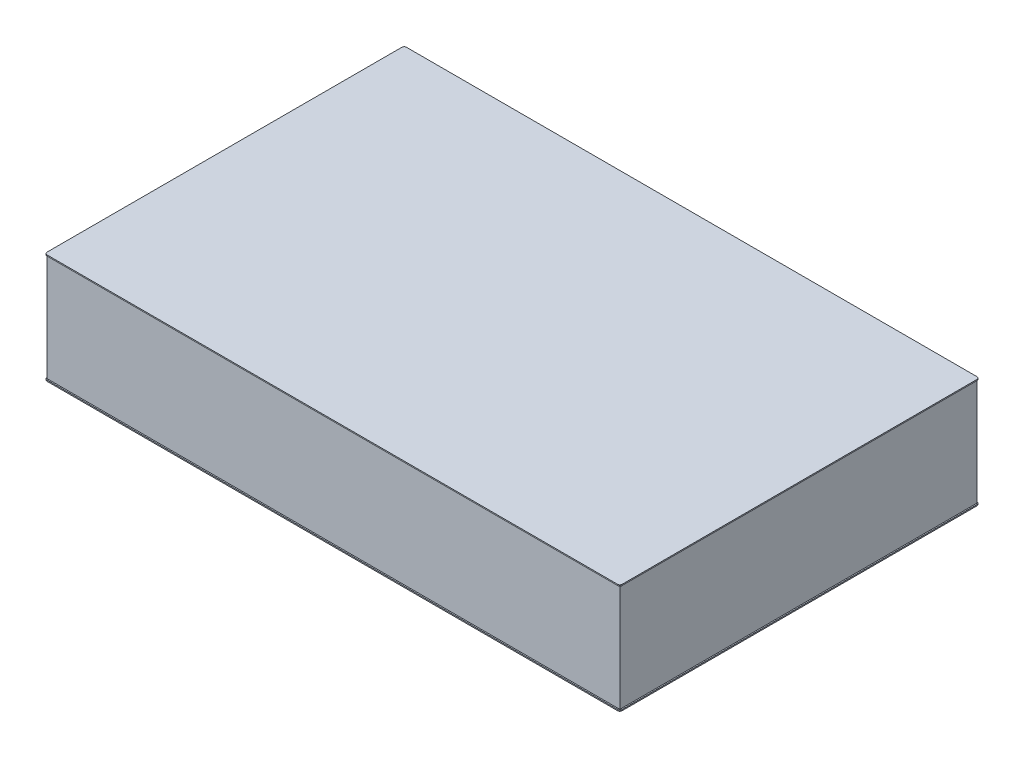
ISO-10303-21;
HEADER;
FILE_DESCRIPTION(('STEP AP214'),'2;1');
FILE_NAME('part.step','',(''),(''),'','','');
FILE_SCHEMA(('AUTOMOTIVE_DESIGN { 1 0 10303 214 1 1 1 1 }'));
ENDSEC;
DATA;
#1=APPLICATION_CONTEXT('core data for automotive mechanical design processes');
#2=APPLICATION_PROTOCOL_DEFINITION('international standard','automotive_design',2000,#1);
#3=PRODUCT_CONTEXT('',#1,'mechanical');
#4=PRODUCT('Part','Part','',(#3));
#5=PRODUCT_RELATED_PRODUCT_CATEGORY('part','',(#4));
#6=PRODUCT_DEFINITION_FORMATION('','',#4);
#7=PRODUCT_DEFINITION_CONTEXT('part definition',#1,'design');
#8=PRODUCT_DEFINITION('design','',#6,#7);
#9=PRODUCT_DEFINITION_SHAPE('','',#8);
#10=(LENGTH_UNIT() NAMED_UNIT(*) SI_UNIT(.MILLI.,.METRE.));
#11=(NAMED_UNIT(*) PLANE_ANGLE_UNIT() SI_UNIT($,.RADIAN.));
#12=(NAMED_UNIT(*) SI_UNIT($,.STERADIAN.) SOLID_ANGLE_UNIT());
#13=UNCERTAINTY_MEASURE_WITH_UNIT(LENGTH_MEASURE(1.E-05),#10,'distance_accuracy_value','');
#14=(GEOMETRIC_REPRESENTATION_CONTEXT(3) GLOBAL_UNCERTAINTY_ASSIGNED_CONTEXT((#13)) GLOBAL_UNIT_ASSIGNED_CONTEXT((#10,
#11,#12)) REPRESENTATION_CONTEXT('',''));
#15=CARTESIAN_POINT('',(0.,0.,0.));
#16=DIRECTION('',(0.,0.,1.));
#17=DIRECTION('',(1.,0.,0.));
#18=AXIS2_PLACEMENT_3D('',#15,#16,#17);
#19=CARTESIAN_POINT('',(1190.348,-4.8,740.348));
#20=DIRECTION('',(0.,1.,0.));
#21=DIRECTION('',(0.,0.,1.));
#22=AXIS2_PLACEMENT_3D('',#19,#20,#21);
#23=PLANE('',#22);
#24=CARTESIAN_POINT('',(1190.348,-4.8,740.348));
#25=DIRECTION('',(0.,1.,0.));
#26=DIRECTION('',(0.,0.,1.));
#27=AXIS2_PLACEMENT_3D('',#24,#25,#26);
#28=CIRCLE('',#27,9.65200000000033);
#29=CARTESIAN_POINT('',(1190.348,-4.8,750.));
#30=VERTEX_POINT('',#29);
#31=CARTESIAN_POINT('',(1200.,-4.8,740.348));
#32=VERTEX_POINT('',#31);
#33=EDGE_CURVE('E230',#30,#32,#28,.T.);
#34=ORIENTED_EDGE('',*,*,#33,.F.);
#35=DIRECTION('',(1.,0.,0.));
#36=VECTOR('',#35,1.);
#37=CARTESIAN_POINT('',(-1190.348,-4.8,750.));
#38=LINE('',#37,#36);
#39=CARTESIAN_POINT('',(-1190.348,-4.8,750.));
#40=VERTEX_POINT('',#39);
#41=EDGE_CURVE('E252',#40,#30,#38,.T.);
#42=ORIENTED_EDGE('',*,*,#41,.F.);
#43=CARTESIAN_POINT('',(-1190.348,-4.8,740.348));
#44=DIRECTION('',(0.,1.,0.));
#45=DIRECTION('',(0.,0.,-1.));
#46=AXIS2_PLACEMENT_3D('',#43,#44,#45);
#47=CIRCLE('',#46,9.65199999999999);
#48=CARTESIAN_POINT('',(-1200.,-4.8,740.348));
#49=VERTEX_POINT('',#48);
#50=EDGE_CURVE('E249',#49,#40,#47,.T.);
#51=ORIENTED_EDGE('',*,*,#50,.F.);
#52=DIRECTION('',(0.,0.,1.));
#53=VECTOR('',#52,1.);
#54=CARTESIAN_POINT('',(-1200.,-4.8,740.348));
#55=LINE('',#54,#53);
#56=CARTESIAN_POINT('',(-1200.,-4.8,-740.348));
#57=VERTEX_POINT('',#56);
#58=EDGE_CURVE('E246',#57,#49,#55,.T.);
#59=ORIENTED_EDGE('',*,*,#58,.F.);
#60=CARTESIAN_POINT('',(-1190.348,-4.8,-740.348));
#61=DIRECTION('',(0.,1.,0.));
#62=DIRECTION('',(0.,0.,-1.));
#63=AXIS2_PLACEMENT_3D('',#60,#61,#62);
#64=CIRCLE('',#63,9.65199999999999);
#65=CARTESIAN_POINT('',(-1190.348,-4.8,-750.));
#66=VERTEX_POINT('',#65);
#67=EDGE_CURVE('E243',#66,#57,#64,.T.);
#68=ORIENTED_EDGE('',*,*,#67,.F.);
#69=DIRECTION('',(-1.,0.,0.));
#70=VECTOR('',#69,1.);
#71=CARTESIAN_POINT('',(-1190.348,-4.8,-750.));
#72=LINE('',#71,#70);
#73=CARTESIAN_POINT('',(1190.348,-4.8,-750.));
#74=VERTEX_POINT('',#73);
#75=EDGE_CURVE('E240',#74,#66,#72,.T.);
#76=ORIENTED_EDGE('',*,*,#75,.F.);
#77=CARTESIAN_POINT('',(1190.348,-4.8,-740.348));
#78=DIRECTION('',(0.,1.,0.));
#79=DIRECTION('',(0.,0.,-1.));
#80=AXIS2_PLACEMENT_3D('',#77,#78,#79);
#81=CIRCLE('',#80,9.65200000000016);
#82=CARTESIAN_POINT('',(1200.,-4.8,-740.348));
#83=VERTEX_POINT('',#82);
#84=EDGE_CURVE('E237',#83,#74,#81,.T.);
#85=ORIENTED_EDGE('',*,*,#84,.F.);
#86=DIRECTION('',(0.,0.,-1.));
#87=VECTOR('',#86,1.);
#88=CARTESIAN_POINT('',(1200.,-4.8,740.348));
#89=LINE('',#88,#87);
#90=EDGE_CURVE('E233',#32,#83,#89,.T.);
#91=ORIENTED_EDGE('',*,*,#90,.F.);
#92=EDGE_LOOP('',(#34,#42,#51,#59,#68,#76,#85,#91));
#93=FACE_BOUND('',#92,.T.);
#94=DIRECTION('',(0.,0.,-1.));
#95=VECTOR('',#94,1.);
#96=CARTESIAN_POINT('',(-1195.,-4.8,745.));
#97=LINE('',#96,#95);
#98=CARTESIAN_POINT('',(-1195.,-4.8,745.));
#99=VERTEX_POINT('',#98);
#100=CARTESIAN_POINT('',(-1195.,-4.8,-745.));
#101=VERTEX_POINT('',#100);
#102=EDGE_CURVE('E193',#99,#101,#97,.T.);
#103=ORIENTED_EDGE('',*,*,#102,.F.);
#104=DIRECTION('',(-1.,0.,0.));
#105=VECTOR('',#104,1.);
#106=CARTESIAN_POINT('',(-1195.,-4.8,745.));
#107=LINE('',#106,#105);
#108=CARTESIAN_POINT('',(1195.,-4.8,745.));
#109=VERTEX_POINT('',#108);
#110=EDGE_CURVE('E205',#109,#99,#107,.T.);
#111=ORIENTED_EDGE('',*,*,#110,.F.);
#112=DIRECTION('',(0.,0.,1.));
#113=VECTOR('',#112,1.);
#114=CARTESIAN_POINT('',(1195.,-4.8,745.));
#115=LINE('',#114,#113);
#116=CARTESIAN_POINT('',(1195.,-4.8,-745.));
#117=VERTEX_POINT('',#116);
#118=EDGE_CURVE('E54',#117,#109,#115,.T.);
#119=ORIENTED_EDGE('',*,*,#118,.F.);
#120=DIRECTION('',(1.,0.,0.));
#121=VECTOR('',#120,1.);
#122=CARTESIAN_POINT('',(-1195.,-4.8,-745.));
#123=LINE('',#122,#121);
#124=EDGE_CURVE('E49',#101,#117,#123,.T.);
#125=ORIENTED_EDGE('',*,*,#124,.F.);
#126=EDGE_LOOP('',(#103,#111,#119,#125));
#127=FACE_BOUND('',#126,.T.);
#128=ADVANCED_FACE('F32',(#93,#127),#23,.F.);
#129=CARTESIAN_POINT('',(1190.348,-4.8,740.348));
#130=DIRECTION('',(0.,1.,0.));
#131=DIRECTION('',(0.,0.,1.));
#132=AXIS2_PLACEMENT_3D('',#129,#130,#131);
#133=CYLINDRICAL_SURFACE('',#132,9.65200000000033);
#134=CARTESIAN_POINT('',(1190.348,0.,740.348));
#135=DIRECTION('',(0.,1.,0.));
#136=DIRECTION('',(0.,0.,1.));
#137=AXIS2_PLACEMENT_3D('',#134,#135,#136);
#138=CIRCLE('',#137,9.65200000000033);
#139=CARTESIAN_POINT('',(1190.348,0.,750.));
#140=VERTEX_POINT('',#139);
#141=CARTESIAN_POINT('',(1200.,0.,740.348));
#142=VERTEX_POINT('',#141);
#143=EDGE_CURVE('E229',#140,#142,#138,.T.);
#144=ORIENTED_EDGE('',*,*,#143,.F.);
#145=DIRECTION('',(0.,1.,0.));
#146=VECTOR('',#145,1.);
#147=CARTESIAN_POINT('',(1190.348,-4.8,750.));
#148=LINE('',#147,#146);
#149=EDGE_CURVE('E11',#30,#140,#148,.T.);
#150=ORIENTED_EDGE('',*,*,#149,.F.);
#151=ORIENTED_EDGE('',*,*,#33,.T.);
#152=DIRECTION('',(0.,1.,0.));
#153=VECTOR('',#152,1.);
#154=CARTESIAN_POINT('',(1200.,-4.8,740.348));
#155=LINE('',#154,#153);
#156=EDGE_CURVE('E36',#32,#142,#155,.T.);
#157=ORIENTED_EDGE('',*,*,#156,.T.);
#158=EDGE_LOOP('',(#144,#150,#151,#157));
#159=FACE_BOUND('',#158,.T.);
#160=ADVANCED_FACE('F34',(#159),#133,.T.);
#161=CARTESIAN_POINT('',(-1190.348,-4.8,750.));
#162=DIRECTION('',(0.,0.,1.));
#163=DIRECTION('',(1.,0.,0.));
#164=AXIS2_PLACEMENT_3D('',#161,#162,#163);
#165=PLANE('',#164);
#166=DIRECTION('',(1.,0.,0.));
#167=VECTOR('',#166,1.);
#168=CARTESIAN_POINT('',(-1190.348,0.,750.));
#169=LINE('',#168,#167);
#170=CARTESIAN_POINT('',(-1190.348,0.,750.));
#171=VERTEX_POINT('',#170);
#172=EDGE_CURVE('E234',#171,#140,#169,.T.);
#173=ORIENTED_EDGE('',*,*,#172,.F.);
#174=DIRECTION('',(0.,1.,0.));
#175=VECTOR('',#174,1.);
#176=CARTESIAN_POINT('',(-1190.348,-4.8,750.));
#177=LINE('',#176,#175);
#178=EDGE_CURVE('E41',#40,#171,#177,.T.);
#179=ORIENTED_EDGE('',*,*,#178,.F.);
#180=ORIENTED_EDGE('',*,*,#41,.T.);
#181=ORIENTED_EDGE('',*,*,#149,.T.);
#182=EDGE_LOOP('',(#173,#179,#180,#181));
#183=FACE_BOUND('',#182,.T.);
#184=ADVANCED_FACE('F299',(#183),#165,.T.);
#185=CARTESIAN_POINT('',(-1190.348,-4.8,740.348));
#186=DIRECTION('',(0.,1.,0.));
#187=DIRECTION('',(0.,0.,1.));
#188=AXIS2_PLACEMENT_3D('',#185,#186,#187);
#189=CYLINDRICAL_SURFACE('',#188,9.65199999999999);
#190=CARTESIAN_POINT('',(-1190.348,0.,740.348));
#191=DIRECTION('',(0.,1.,0.));
#192=DIRECTION('',(0.,0.,-1.));
#193=AXIS2_PLACEMENT_3D('',#190,#191,#192);
#194=CIRCLE('',#193,9.65199999999999);
#195=CARTESIAN_POINT('',(-1200.,0.,740.348));
#196=VERTEX_POINT('',#195);
#197=EDGE_CURVE('E272',#196,#171,#194,.T.);
#198=ORIENTED_EDGE('',*,*,#197,.F.);
#199=DIRECTION('',(0.,1.,0.));
#200=VECTOR('',#199,1.);
#201=CARTESIAN_POINT('',(-1200.,-4.8,740.348));
#202=LINE('',#201,#200);
#203=EDGE_CURVE('E278',#49,#196,#202,.T.);
#204=ORIENTED_EDGE('',*,*,#203,.F.);
#205=ORIENTED_EDGE('',*,*,#50,.T.);
#206=ORIENTED_EDGE('',*,*,#178,.T.);
#207=EDGE_LOOP('',(#198,#204,#205,#206));
#208=FACE_BOUND('',#207,.T.);
#209=ADVANCED_FACE('F319',(#208),#189,.T.);
#210=CARTESIAN_POINT('',(-1200.,-4.8,740.348));
#211=DIRECTION('',(-1.,0.,0.));
#212=DIRECTION('',(0.,0.,1.));
#213=AXIS2_PLACEMENT_3D('',#210,#211,#212);
#214=PLANE('',#213);
#215=DIRECTION('',(0.,0.,1.));
#216=VECTOR('',#215,1.);
#217=CARTESIAN_POINT('',(-1200.,0.,740.348));
#218=LINE('',#217,#216);
#219=CARTESIAN_POINT('',(-1200.,0.,-740.348));
#220=VERTEX_POINT('',#219);
#221=EDGE_CURVE('E269',#220,#196,#218,.T.);
#222=ORIENTED_EDGE('',*,*,#221,.F.);
#223=DIRECTION('',(0.,1.,0.));
#224=VECTOR('',#223,1.);
#225=CARTESIAN_POINT('',(-1200.,-4.8,-740.348));
#226=LINE('',#225,#224);
#227=EDGE_CURVE('E280',#57,#220,#226,.T.);
#228=ORIENTED_EDGE('',*,*,#227,.F.);
#229=ORIENTED_EDGE('',*,*,#58,.T.);
#230=ORIENTED_EDGE('',*,*,#203,.T.);
#231=EDGE_LOOP('',(#222,#228,#229,#230));
#232=FACE_BOUND('',#231,.T.);
#233=ADVANCED_FACE('F317',(#232),#214,.T.);
#234=CARTESIAN_POINT('',(-1190.348,-4.8,-740.348));
#235=DIRECTION('',(0.,1.,0.));
#236=DIRECTION('',(0.,0.,1.));
#237=AXIS2_PLACEMENT_3D('',#234,#235,#236);
#238=CYLINDRICAL_SURFACE('',#237,9.65199999999999);
#239=CARTESIAN_POINT('',(-1190.348,0.,-740.348));
#240=DIRECTION('',(0.,1.,0.));
#241=DIRECTION('',(0.,0.,-1.));
#242=AXIS2_PLACEMENT_3D('',#239,#240,#241);
#243=CIRCLE('',#242,9.65199999999999);
#244=CARTESIAN_POINT('',(-1190.348,0.,-750.));
#245=VERTEX_POINT('',#244);
#246=EDGE_CURVE('E266',#245,#220,#243,.T.);
#247=ORIENTED_EDGE('',*,*,#246,.F.);
#248=DIRECTION('',(0.,1.,0.));
#249=VECTOR('',#248,1.);
#250=CARTESIAN_POINT('',(-1190.348,-4.8,-750.));
#251=LINE('',#250,#249);
#252=EDGE_CURVE('E282',#66,#245,#251,.T.);
#253=ORIENTED_EDGE('',*,*,#252,.F.);
#254=ORIENTED_EDGE('',*,*,#67,.T.);
#255=ORIENTED_EDGE('',*,*,#227,.T.);
#256=EDGE_LOOP('',(#247,#253,#254,#255));
#257=FACE_BOUND('',#256,.T.);
#258=ADVANCED_FACE('F313',(#257),#238,.T.);
#259=CARTESIAN_POINT('',(-1190.348,-4.8,-750.));
#260=DIRECTION('',(0.,0.,-1.));
#261=DIRECTION('',(-1.,0.,0.));
#262=AXIS2_PLACEMENT_3D('',#259,#260,#261);
#263=PLANE('',#262);
#264=DIRECTION('',(-1.,0.,0.));
#265=VECTOR('',#264,1.);
#266=CARTESIAN_POINT('',(-1190.348,0.,-750.));
#267=LINE('',#266,#265);
#268=CARTESIAN_POINT('',(1190.348,0.,-750.));
#269=VERTEX_POINT('',#268);
#270=EDGE_CURVE('E263',#269,#245,#267,.T.);
#271=ORIENTED_EDGE('',*,*,#270,.F.);
#272=DIRECTION('',(0.,1.,0.));
#273=VECTOR('',#272,1.);
#274=CARTESIAN_POINT('',(1190.348,-4.8,-750.));
#275=LINE('',#274,#273);
#276=EDGE_CURVE('E284',#74,#269,#275,.T.);
#277=ORIENTED_EDGE('',*,*,#276,.F.);
#278=ORIENTED_EDGE('',*,*,#75,.T.);
#279=ORIENTED_EDGE('',*,*,#252,.T.);
#280=EDGE_LOOP('',(#271,#277,#278,#279));
#281=FACE_BOUND('',#280,.T.);
#282=ADVANCED_FACE('F311',(#281),#263,.T.);
#283=CARTESIAN_POINT('',(1190.348,-4.8,-740.348));
#284=DIRECTION('',(0.,1.,0.));
#285=DIRECTION('',(0.,0.,1.));
#286=AXIS2_PLACEMENT_3D('',#283,#284,#285);
#287=CYLINDRICAL_SURFACE('',#286,9.65200000000016);
#288=CARTESIAN_POINT('',(1190.348,0.,-740.348));
#289=DIRECTION('',(0.,1.,0.));
#290=DIRECTION('',(0.,0.,-1.));
#291=AXIS2_PLACEMENT_3D('',#288,#289,#290);
#292=CIRCLE('',#291,9.65200000000016);
#293=CARTESIAN_POINT('',(1200.,0.,-740.348));
#294=VERTEX_POINT('',#293);
#295=EDGE_CURVE('E260',#294,#269,#292,.T.);
#296=ORIENTED_EDGE('',*,*,#295,.F.);
#297=DIRECTION('',(0.,1.,0.));
#298=VECTOR('',#297,1.);
#299=CARTESIAN_POINT('',(1200.,-4.8,-740.348));
#300=LINE('',#299,#298);
#301=EDGE_CURVE('E285',#83,#294,#300,.T.);
#302=ORIENTED_EDGE('',*,*,#301,.F.);
#303=ORIENTED_EDGE('',*,*,#84,.T.);
#304=ORIENTED_EDGE('',*,*,#276,.T.);
#305=EDGE_LOOP('',(#296,#302,#303,#304));
#306=FACE_BOUND('',#305,.T.);
#307=ADVANCED_FACE('F307',(#306),#287,.T.);
#308=CARTESIAN_POINT('',(1200.,-4.8,740.348));
#309=DIRECTION('',(1.,0.,0.));
#310=DIRECTION('',(0.,0.,-1.));
#311=AXIS2_PLACEMENT_3D('',#308,#309,#310);
#312=PLANE('',#311);
#313=DIRECTION('',(0.,0.,-1.));
#314=VECTOR('',#313,1.);
#315=CARTESIAN_POINT('',(1200.,0.,740.348));
#316=LINE('',#315,#314);
#317=EDGE_CURVE('E257',#142,#294,#316,.T.);
#318=ORIENTED_EDGE('',*,*,#317,.F.);
#319=ORIENTED_EDGE('',*,*,#156,.F.);
#320=ORIENTED_EDGE('',*,*,#90,.T.);
#321=ORIENTED_EDGE('',*,*,#301,.T.);
#322=EDGE_LOOP('',(#318,#319,#320,#321));
#323=FACE_BOUND('',#322,.T.);
#324=ADVANCED_FACE('F293',(#323),#312,.T.);
#325=CARTESIAN_POINT('',(1190.348,0.,740.348));
#326=DIRECTION('',(0.,1.,0.));
#327=DIRECTION('',(0.,0.,1.));
#328=AXIS2_PLACEMENT_3D('',#325,#326,#327);
#329=PLANE('',#328);
#330=ORIENTED_EDGE('',*,*,#143,.T.);
#331=ORIENTED_EDGE('',*,*,#317,.T.);
#332=ORIENTED_EDGE('',*,*,#295,.T.);
#333=ORIENTED_EDGE('',*,*,#270,.T.);
#334=ORIENTED_EDGE('',*,*,#246,.T.);
#335=ORIENTED_EDGE('',*,*,#221,.T.);
#336=ORIENTED_EDGE('',*,*,#197,.T.);
#337=ORIENTED_EDGE('',*,*,#172,.T.);
#338=EDGE_LOOP('',(#330,#331,#332,#333,#334,#335,#336,#337));
#339=FACE_BOUND('',#338,.T.);
#340=ADVANCED_FACE('F295',(#339),#329,.T.);
#341=CARTESIAN_POINT('',(-1195.,-452.2,745.));
#342=DIRECTION('',(1.,0.,0.));
#343=DIRECTION('',(0.,0.,-1.));
#344=AXIS2_PLACEMENT_3D('',#341,#342,#343);
#345=PLANE('',#344);
#346=ORIENTED_EDGE('',*,*,#102,.T.);
#347=DIRECTION('',(0.,1.,0.));
#348=VECTOR('',#347,1.);
#349=CARTESIAN_POINT('',(-1195.,-452.2,-745.));
#350=LINE('',#349,#348);
#351=CARTESIAN_POINT('',(-1195.,-452.2,-745.));
#352=VERTEX_POINT('',#351);
#353=EDGE_CURVE('E227',#352,#101,#350,.T.);
#354=ORIENTED_EDGE('',*,*,#353,.F.);
#355=DIRECTION('',(0.,0.,-1.));
#356=VECTOR('',#355,1.);
#357=CARTESIAN_POINT('',(-1195.,-452.2,745.));
#358=LINE('',#357,#356);
#359=CARTESIAN_POINT('',(-1195.,-452.2,745.));
#360=VERTEX_POINT('',#359);
#361=EDGE_CURVE('E201',#360,#352,#358,.T.);
#362=ORIENTED_EDGE('',*,*,#361,.F.);
#363=DIRECTION('',(0.,1.,0.));
#364=VECTOR('',#363,1.);
#365=CARTESIAN_POINT('',(-1195.,-452.2,745.));
#366=LINE('',#365,#364);
#367=EDGE_CURVE('E213',#360,#99,#366,.T.);
#368=ORIENTED_EDGE('',*,*,#367,.T.);
#369=EDGE_LOOP('',(#346,#354,#362,#368));
#370=FACE_BOUND('',#369,.T.);
#371=ADVANCED_FACE('F335',(#370),#345,.F.);
#372=CARTESIAN_POINT('',(-1195.,-452.2,-745.));
#373=DIRECTION('',(0.,0.,1.));
#374=DIRECTION('',(1.,0.,0.));
#375=AXIS2_PLACEMENT_3D('',#372,#373,#374);
#376=PLANE('',#375);
#377=ORIENTED_EDGE('',*,*,#124,.T.);
#378=DIRECTION('',(0.,1.,0.));
#379=VECTOR('',#378,1.);
#380=CARTESIAN_POINT('',(1195.,-452.2,-745.));
#381=LINE('',#380,#379);
#382=CARTESIAN_POINT('',(1195.,-452.2,-745.));
#383=VERTEX_POINT('',#382);
#384=EDGE_CURVE('E224',#383,#117,#381,.T.);
#385=ORIENTED_EDGE('',*,*,#384,.F.);
#386=DIRECTION('',(1.,0.,0.));
#387=VECTOR('',#386,1.);
#388=CARTESIAN_POINT('',(-1195.,-452.2,-745.));
#389=LINE('',#388,#387);
#390=EDGE_CURVE('E204',#352,#383,#389,.T.);
#391=ORIENTED_EDGE('',*,*,#390,.F.);
#392=ORIENTED_EDGE('',*,*,#353,.T.);
#393=EDGE_LOOP('',(#377,#385,#391,#392));
#394=FACE_BOUND('',#393,.T.);
#395=ADVANCED_FACE('F342',(#394),#376,.F.);
#396=CARTESIAN_POINT('',(1195.,-452.2,745.));
#397=DIRECTION('',(-1.,0.,0.));
#398=DIRECTION('',(0.,0.,1.));
#399=AXIS2_PLACEMENT_3D('',#396,#397,#398);
#400=PLANE('',#399);
#401=ORIENTED_EDGE('',*,*,#118,.T.);
#402=DIRECTION('',(0.,1.,0.));
#403=VECTOR('',#402,1.);
#404=CARTESIAN_POINT('',(1195.,-452.2,745.));
#405=LINE('',#404,#403);
#406=CARTESIAN_POINT('',(1195.,-452.2,745.));
#407=VERTEX_POINT('',#406);
#408=EDGE_CURVE('E221',#407,#109,#405,.T.);
#409=ORIENTED_EDGE('',*,*,#408,.F.);
#410=DIRECTION('',(0.,0.,1.));
#411=VECTOR('',#410,1.);
#412=CARTESIAN_POINT('',(1195.,-452.2,745.));
#413=LINE('',#412,#411);
#414=EDGE_CURVE('E208',#383,#407,#413,.T.);
#415=ORIENTED_EDGE('',*,*,#414,.F.);
#416=ORIENTED_EDGE('',*,*,#384,.T.);
#417=EDGE_LOOP('',(#401,#409,#415,#416));
#418=FACE_BOUND('',#417,.T.);
#419=ADVANCED_FACE('F391',(#418),#400,.F.);
#420=CARTESIAN_POINT('',(-1195.,-452.2,745.));
#421=DIRECTION('',(0.,0.,-1.));
#422=DIRECTION('',(-1.,0.,0.));
#423=AXIS2_PLACEMENT_3D('',#420,#421,#422);
#424=PLANE('',#423);
#425=ORIENTED_EDGE('',*,*,#110,.T.);
#426=ORIENTED_EDGE('',*,*,#367,.F.);
#427=DIRECTION('',(-1.,0.,0.));
#428=VECTOR('',#427,1.);
#429=CARTESIAN_POINT('',(-1195.,-452.2,745.));
#430=LINE('',#429,#428);
#431=EDGE_CURVE('E211',#407,#360,#430,.T.);
#432=ORIENTED_EDGE('',*,*,#431,.F.);
#433=ORIENTED_EDGE('',*,*,#408,.T.);
#434=EDGE_LOOP('',(#425,#426,#432,#433));
#435=FACE_BOUND('',#434,.T.);
#436=ADVANCED_FACE('F400',(#435),#424,.F.);
#437=CARTESIAN_POINT('',(-1190.348,-452.2,740.348));
#438=DIRECTION('',(0.,1.,0.));
#439=DIRECTION('',(0.,0.,1.));
#440=AXIS2_PLACEMENT_3D('',#437,#438,#439);
#441=PLANE('',#440);
#442=CARTESIAN_POINT('',(-1190.348,-452.2,740.348));
#443=DIRECTION('',(0.,-1.,0.));
#444=DIRECTION('',(0.,0.,1.));
#445=AXIS2_PLACEMENT_3D('',#442,#443,#444);
#446=CIRCLE('',#445,9.65199999999994);
#447=CARTESIAN_POINT('',(-1190.348,-452.2,749.999999999999));
#448=VERTEX_POINT('',#447);
#449=CARTESIAN_POINT('',(-1200.,-452.2,740.348));
#450=VERTEX_POINT('',#449);
#451=EDGE_CURVE('E192',#448,#450,#446,.T.);
#452=ORIENTED_EDGE('',*,*,#451,.F.);
#453=DIRECTION('',(-1.,0.,0.));
#454=VECTOR('',#453,1.);
#455=CARTESIAN_POINT('',(1190.348,-452.2,750.));
#456=LINE('',#455,#454);
#457=CARTESIAN_POINT('',(1190.348,-452.2,750.));
#458=VERTEX_POINT('',#457);
#459=EDGE_CURVE('E188',#458,#448,#456,.T.);
#460=ORIENTED_EDGE('',*,*,#459,.F.);
#461=CARTESIAN_POINT('',(1190.348,-452.2,740.348));
#462=DIRECTION('',(0.,-1.,0.));
#463=DIRECTION('',(0.,0.,1.));
#464=AXIS2_PLACEMENT_3D('',#461,#462,#463);
#465=CIRCLE('',#464,9.65199999999999);
#466=CARTESIAN_POINT('',(1200.,-452.2,740.348));
#467=VERTEX_POINT('',#466);
#468=EDGE_CURVE('E514',#467,#458,#465,.T.);
#469=ORIENTED_EDGE('',*,*,#468,.F.);
#470=DIRECTION('',(0.,0.,1.));
#471=VECTOR('',#470,1.);
#472=CARTESIAN_POINT('',(1200.,-452.2,740.348));
#473=LINE('',#472,#471);
#474=CARTESIAN_POINT('',(1200.,-452.2,-740.348));
#475=VERTEX_POINT('',#474);
#476=EDGE_CURVE('E531',#475,#467,#473,.T.);
#477=ORIENTED_EDGE('',*,*,#476,.F.);
#478=CARTESIAN_POINT('',(1190.348,-452.2,-740.348));
#479=DIRECTION('',(0.,-1.,0.));
#480=DIRECTION('',(0.,0.,-1.));
#481=AXIS2_PLACEMENT_3D('',#478,#479,#480);
#482=CIRCLE('',#481,9.65199999999983);
#483=CARTESIAN_POINT('',(1190.348,-452.2,-750.));
#484=VERTEX_POINT('',#483);
#485=EDGE_CURVE('E529',#484,#475,#482,.T.);
#486=ORIENTED_EDGE('',*,*,#485,.F.);
#487=DIRECTION('',(1.,0.,0.));
#488=VECTOR('',#487,1.);
#489=CARTESIAN_POINT('',(1190.348,-452.2,-750.));
#490=LINE('',#489,#488);
#491=CARTESIAN_POINT('',(-1190.348,-452.2,-750.));
#492=VERTEX_POINT('',#491);
#493=EDGE_CURVE('E527',#492,#484,#490,.T.);
#494=ORIENTED_EDGE('',*,*,#493,.F.);
#495=CARTESIAN_POINT('',(-1190.348,-452.2,-740.348));
#496=DIRECTION('',(0.,-1.,0.));
#497=DIRECTION('',(0.,0.,-1.));
#498=AXIS2_PLACEMENT_3D('',#495,#496,#497);
#499=CIRCLE('',#498,9.65199999999988);
#500=CARTESIAN_POINT('',(-1200.,-452.2,-740.348));
#501=VERTEX_POINT('',#500);
#502=EDGE_CURVE('E521',#501,#492,#499,.T.);
#503=ORIENTED_EDGE('',*,*,#502,.F.);
#504=DIRECTION('',(0.,0.,-1.));
#505=VECTOR('',#504,1.);
#506=CARTESIAN_POINT('',(-1200.,-452.2,740.348));
#507=LINE('',#506,#505);
#508=EDGE_CURVE('E519',#450,#501,#507,.T.);
#509=ORIENTED_EDGE('',*,*,#508,.F.);
#510=EDGE_LOOP('',(#452,#460,#469,#477,#486,#494,#503,#509));
#511=FACE_BOUND('',#510,.T.);
#512=ORIENTED_EDGE('',*,*,#361,.T.);
#513=ORIENTED_EDGE('',*,*,#390,.T.);
#514=ORIENTED_EDGE('',*,*,#414,.T.);
#515=ORIENTED_EDGE('',*,*,#431,.T.);
#516=EDGE_LOOP('',(#512,#513,#514,#515));
#517=FACE_BOUND('',#516,.T.);
#518=ADVANCED_FACE('F410',(#511,#517),#441,.T.);
#519=CARTESIAN_POINT('',(-1190.348,-457.,740.348));
#520=DIRECTION('',(0.,1.,0.));
#521=DIRECTION('',(0.,0.,1.));
#522=AXIS2_PLACEMENT_3D('',#519,#520,#521);
#523=CYLINDRICAL_SURFACE('',#522,9.65199999999994);
#524=ORIENTED_EDGE('',*,*,#451,.T.);
#525=DIRECTION('',(0.,1.,0.));
#526=VECTOR('',#525,1.);
#527=CARTESIAN_POINT('',(-1200.,-457.,740.348));
#528=LINE('',#527,#526);
#529=CARTESIAN_POINT('',(-1200.,-457.,740.348));
#530=VERTEX_POINT('',#529);
#531=EDGE_CURVE('E172',#530,#450,#528,.T.);
#532=ORIENTED_EDGE('',*,*,#531,.F.);
#533=CARTESIAN_POINT('',(-1190.348,-457.,740.348));
#534=DIRECTION('',(0.,-1.,0.));
#535=DIRECTION('',(0.,0.,1.));
#536=AXIS2_PLACEMENT_3D('',#533,#534,#535);
#537=CIRCLE('',#536,9.65199999999994);
#538=CARTESIAN_POINT('',(-1190.348,-457.,749.999999999999));
#539=VERTEX_POINT('',#538);
#540=EDGE_CURVE('E179',#539,#530,#537,.T.);
#541=ORIENTED_EDGE('',*,*,#540,.F.);
#542=DIRECTION('',(0.,1.,0.));
#543=VECTOR('',#542,1.);
#544=CARTESIAN_POINT('',(-1190.348,-457.,749.999999999999));
#545=LINE('',#544,#543);
#546=EDGE_CURVE('E510',#539,#448,#545,.T.);
#547=ORIENTED_EDGE('',*,*,#546,.T.);
#548=EDGE_LOOP('',(#524,#532,#541,#547));
#549=FACE_BOUND('',#548,.T.);
#550=ADVANCED_FACE('F190',(#549),#523,.T.);
#551=CARTESIAN_POINT('',(-1200.,-457.,740.348));
#552=DIRECTION('',(1.,0.,0.));
#553=DIRECTION('',(0.,0.,-1.));
#554=AXIS2_PLACEMENT_3D('',#551,#552,#553);
#555=PLANE('',#554);
#556=ORIENTED_EDGE('',*,*,#508,.T.);
#557=DIRECTION('',(0.,1.,0.));
#558=VECTOR('',#557,1.);
#559=CARTESIAN_POINT('',(-1200.,-457.,-740.348));
#560=LINE('',#559,#558);
#561=CARTESIAN_POINT('',(-1200.,-457.,-740.348));
#562=VERTEX_POINT('',#561);
#563=EDGE_CURVE('E175',#562,#501,#560,.T.);
#564=ORIENTED_EDGE('',*,*,#563,.F.);
#565=DIRECTION('',(0.,0.,-1.));
#566=VECTOR('',#565,1.);
#567=CARTESIAN_POINT('',(-1200.,-457.,740.348));
#568=LINE('',#567,#566);
#569=EDGE_CURVE('E168',#530,#562,#568,.T.);
#570=ORIENTED_EDGE('',*,*,#569,.F.);
#571=ORIENTED_EDGE('',*,*,#531,.T.);
#572=EDGE_LOOP('',(#556,#564,#570,#571));
#573=FACE_BOUND('',#572,.T.);
#574=ADVANCED_FACE('F170',(#573),#555,.F.);
#575=CARTESIAN_POINT('',(-1190.348,-457.,-740.348));
#576=DIRECTION('',(0.,1.,0.));
#577=DIRECTION('',(0.,0.,1.));
#578=AXIS2_PLACEMENT_3D('',#575,#576,#577);
#579=CYLINDRICAL_SURFACE('',#578,9.65199999999988);
#580=ORIENTED_EDGE('',*,*,#502,.T.);
#581=DIRECTION('',(0.,1.,0.));
#582=VECTOR('',#581,1.);
#583=CARTESIAN_POINT('',(-1190.348,-457.,-750.));
#584=LINE('',#583,#582);
#585=CARTESIAN_POINT('',(-1190.348,-457.,-750.));
#586=VERTEX_POINT('',#585);
#587=EDGE_CURVE('E197',#586,#492,#584,.T.);
#588=ORIENTED_EDGE('',*,*,#587,.F.);
#589=CARTESIAN_POINT('',(-1190.348,-457.,-740.348));
#590=DIRECTION('',(0.,-1.,0.));
#591=DIRECTION('',(0.,0.,-1.));
#592=AXIS2_PLACEMENT_3D('',#589,#590,#591);
#593=CIRCLE('',#592,9.65199999999988);
#594=EDGE_CURVE('E178',#562,#586,#593,.T.);
#595=ORIENTED_EDGE('',*,*,#594,.F.);
#596=ORIENTED_EDGE('',*,*,#563,.T.);
#597=EDGE_LOOP('',(#580,#588,#595,#596));
#598=FACE_BOUND('',#597,.T.);
#599=ADVANCED_FACE('F437',(#598),#579,.T.);
#600=CARTESIAN_POINT('',(1190.348,-457.,-750.));
#601=DIRECTION('',(0.,0.,1.));
#602=DIRECTION('',(1.,0.,0.));
#603=AXIS2_PLACEMENT_3D('',#600,#601,#602);
#604=PLANE('',#603);
#605=ORIENTED_EDGE('',*,*,#493,.T.);
#606=DIRECTION('',(0.,1.,0.));
#607=VECTOR('',#606,1.);
#608=CARTESIAN_POINT('',(1190.348,-457.,-750.));
#609=LINE('',#608,#607);
#610=CARTESIAN_POINT('',(1190.348,-457.,-750.));
#611=VERTEX_POINT('',#610);
#612=EDGE_CURVE('E541',#611,#484,#609,.T.);
#613=ORIENTED_EDGE('',*,*,#612,.F.);
#614=DIRECTION('',(1.,0.,0.));
#615=VECTOR('',#614,1.);
#616=CARTESIAN_POINT('',(1190.348,-457.,-750.));
#617=LINE('',#616,#615);
#618=EDGE_CURVE('E548',#586,#611,#617,.T.);
#619=ORIENTED_EDGE('',*,*,#618,.F.);
#620=ORIENTED_EDGE('',*,*,#587,.T.);
#621=EDGE_LOOP('',(#605,#613,#619,#620));
#622=FACE_BOUND('',#621,.T.);
#623=ADVANCED_FACE('F446',(#622),#604,.F.);
#624=CARTESIAN_POINT('',(1190.348,-457.,-740.348));
#625=DIRECTION('',(0.,1.,0.));
#626=DIRECTION('',(0.,0.,1.));
#627=AXIS2_PLACEMENT_3D('',#624,#625,#626);
#628=CYLINDRICAL_SURFACE('',#627,9.65199999999983);
#629=ORIENTED_EDGE('',*,*,#485,.T.);
#630=DIRECTION('',(0.,1.,0.));
#631=VECTOR('',#630,1.);
#632=CARTESIAN_POINT('',(1200.,-457.,-740.348));
#633=LINE('',#632,#631);
#634=CARTESIAN_POINT('',(1200.,-457.,-740.348));
#635=VERTEX_POINT('',#634);
#636=EDGE_CURVE('E538',#635,#475,#633,.T.);
#637=ORIENTED_EDGE('',*,*,#636,.F.);
#638=CARTESIAN_POINT('',(1190.348,-457.,-740.348));
#639=DIRECTION('',(0.,-1.,0.));
#640=DIRECTION('',(0.,0.,-1.));
#641=AXIS2_PLACEMENT_3D('',#638,#639,#640);
#642=CIRCLE('',#641,9.65199999999983);
#643=EDGE_CURVE('E558',#611,#635,#642,.T.);
#644=ORIENTED_EDGE('',*,*,#643,.F.);
#645=ORIENTED_EDGE('',*,*,#612,.T.);
#646=EDGE_LOOP('',(#629,#637,#644,#645));
#647=FACE_BOUND('',#646,.T.);
#648=ADVANCED_FACE('F456',(#647),#628,.T.);
#649=CARTESIAN_POINT('',(1200.,-457.,740.348));
#650=DIRECTION('',(-1.,0.,0.));
#651=DIRECTION('',(0.,0.,1.));
#652=AXIS2_PLACEMENT_3D('',#649,#650,#651);
#653=PLANE('',#652);
#654=ORIENTED_EDGE('',*,*,#476,.T.);
#655=DIRECTION('',(0.,1.,0.));
#656=VECTOR('',#655,1.);
#657=CARTESIAN_POINT('',(1200.,-457.,740.348));
#658=LINE('',#657,#656);
#659=CARTESIAN_POINT('',(1200.,-457.,740.348));
#660=VERTEX_POINT('',#659);
#661=EDGE_CURVE('E535',#660,#467,#658,.T.);
#662=ORIENTED_EDGE('',*,*,#661,.F.);
#663=DIRECTION('',(0.,0.,1.));
#664=VECTOR('',#663,1.);
#665=CARTESIAN_POINT('',(1200.,-457.,740.348));
#666=LINE('',#665,#664);
#667=EDGE_CURVE('E555',#635,#660,#666,.T.);
#668=ORIENTED_EDGE('',*,*,#667,.F.);
#669=ORIENTED_EDGE('',*,*,#636,.T.);
#670=EDGE_LOOP('',(#654,#662,#668,#669));
#671=FACE_BOUND('',#670,.T.);
#672=ADVANCED_FACE('F466',(#671),#653,.F.);
#673=CARTESIAN_POINT('',(1190.348,-457.,740.348));
#674=DIRECTION('',(0.,1.,0.));
#675=DIRECTION('',(0.,0.,1.));
#676=AXIS2_PLACEMENT_3D('',#673,#674,#675);
#677=CYLINDRICAL_SURFACE('',#676,9.65199999999999);
#678=ORIENTED_EDGE('',*,*,#468,.T.);
#679=DIRECTION('',(0.,1.,0.));
#680=VECTOR('',#679,1.);
#681=CARTESIAN_POINT('',(1190.348,-457.,750.));
#682=LINE('',#681,#680);
#683=CARTESIAN_POINT('',(1190.348,-457.,750.));
#684=VERTEX_POINT('',#683);
#685=EDGE_CURVE('E512',#684,#458,#682,.T.);
#686=ORIENTED_EDGE('',*,*,#685,.F.);
#687=CARTESIAN_POINT('',(1190.348,-457.,740.348));
#688=DIRECTION('',(0.,-1.,0.));
#689=DIRECTION('',(0.,0.,1.));
#690=AXIS2_PLACEMENT_3D('',#687,#688,#689);
#691=CIRCLE('',#690,9.65199999999999);
#692=EDGE_CURVE('E557',#660,#684,#691,.T.);
#693=ORIENTED_EDGE('',*,*,#692,.F.);
#694=ORIENTED_EDGE('',*,*,#661,.T.);
#695=EDGE_LOOP('',(#678,#686,#693,#694));
#696=FACE_BOUND('',#695,.T.);
#697=ADVANCED_FACE('F476',(#696),#677,.T.);
#698=CARTESIAN_POINT('',(1190.348,-457.,750.));
#699=DIRECTION('',(0.,0.,-1.));
#700=DIRECTION('',(-1.,0.,0.));
#701=AXIS2_PLACEMENT_3D('',#698,#699,#700);
#702=PLANE('',#701);
#703=ORIENTED_EDGE('',*,*,#459,.T.);
#704=ORIENTED_EDGE('',*,*,#546,.F.);
#705=DIRECTION('',(-1.,0.,0.));
#706=VECTOR('',#705,1.);
#707=CARTESIAN_POINT('',(1190.348,-457.,750.));
#708=LINE('',#707,#706);
#709=EDGE_CURVE('E184',#684,#539,#708,.T.);
#710=ORIENTED_EDGE('',*,*,#709,.F.);
#711=ORIENTED_EDGE('',*,*,#685,.T.);
#712=EDGE_LOOP('',(#703,#704,#710,#711));
#713=FACE_BOUND('',#712,.T.);
#714=ADVANCED_FACE('F486',(#713),#702,.F.);
#715=CARTESIAN_POINT('',(-1190.348,-457.,740.348));
#716=DIRECTION('',(0.,1.,0.));
#717=DIRECTION('',(0.,0.,1.));
#718=AXIS2_PLACEMENT_3D('',#715,#716,#717);
#719=PLANE('',#718);
#720=ORIENTED_EDGE('',*,*,#540,.T.);
#721=ORIENTED_EDGE('',*,*,#569,.T.);
#722=ORIENTED_EDGE('',*,*,#594,.T.);
#723=ORIENTED_EDGE('',*,*,#618,.T.);
#724=ORIENTED_EDGE('',*,*,#643,.T.);
#725=ORIENTED_EDGE('',*,*,#667,.T.);
#726=ORIENTED_EDGE('',*,*,#692,.T.);
#727=ORIENTED_EDGE('',*,*,#709,.T.);
#728=EDGE_LOOP('',(#720,#721,#722,#723,#724,#725,#726,#727));
#729=FACE_BOUND('',#728,.T.);
#730=ADVANCED_FACE('F182',(#729),#719,.F.);
#731=CLOSED_SHELL('',(#128,#160,#184,#209,#233,#258,#282,#307,#324,#340,#371,#395,#419,#436,
#518,#550,#574,#599,#623,#648,#672,#697,#714,#730));
#732=MANIFOLD_SOLID_BREP('B2',#731);
#733=ADVANCED_BREP_SHAPE_REPRESENTATION('',(#18,#732),#14);
#734=SHAPE_DEFINITION_REPRESENTATION(#9,#733);
ENDSEC;
END-ISO-10303-21;
